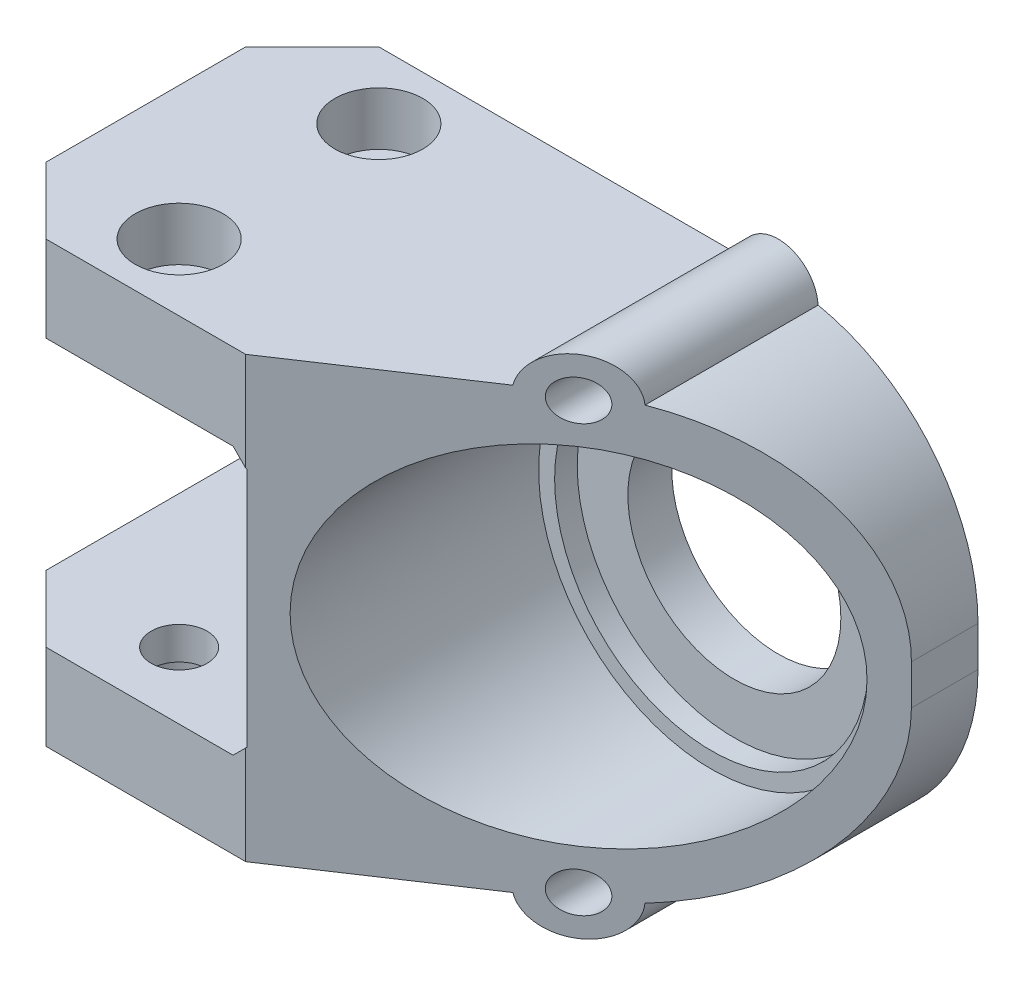
ISO-10303-21;
HEADER;
FILE_DESCRIPTION(('STEP AP214'),'2;1');
FILE_NAME('part.step','',(''),(''),'','','');
FILE_SCHEMA(('AUTOMOTIVE_DESIGN { 1 0 10303 214 1 1 1 1 }'));
ENDSEC;
DATA;
#1=APPLICATION_CONTEXT('core data for automotive mechanical design processes');
#2=APPLICATION_PROTOCOL_DEFINITION('international standard','automotive_design',2000,#1);
#3=PRODUCT_CONTEXT('',#1,'mechanical');
#4=PRODUCT('Part','Part','',(#3));
#5=PRODUCT_RELATED_PRODUCT_CATEGORY('part','',(#4));
#6=PRODUCT_DEFINITION_FORMATION('','',#4);
#7=PRODUCT_DEFINITION_CONTEXT('part definition',#1,'design');
#8=PRODUCT_DEFINITION('design','',#6,#7);
#9=PRODUCT_DEFINITION_SHAPE('','',#8);
#10=(LENGTH_UNIT() NAMED_UNIT(*) SI_UNIT(.MILLI.,.METRE.));
#11=(NAMED_UNIT(*) PLANE_ANGLE_UNIT() SI_UNIT($,.RADIAN.));
#12=(NAMED_UNIT(*) SI_UNIT($,.STERADIAN.) SOLID_ANGLE_UNIT());
#13=UNCERTAINTY_MEASURE_WITH_UNIT(LENGTH_MEASURE(1.E-05),#10,'distance_accuracy_value','');
#14=(GEOMETRIC_REPRESENTATION_CONTEXT(3) GLOBAL_UNCERTAINTY_ASSIGNED_CONTEXT((#13)) GLOBAL_UNIT_ASSIGNED_CONTEXT((#10,
#11,#12)) REPRESENTATION_CONTEXT('',''));
#15=CARTESIAN_POINT('',(0.,0.,0.));
#16=DIRECTION('',(0.,0.,1.));
#17=DIRECTION('',(1.,0.,0.));
#18=AXIS2_PLACEMENT_3D('',#15,#16,#17);
#19=CARTESIAN_POINT('',(0.,33.,0.));
#20=DIRECTION('',(0.,1.,0.));
#21=DIRECTION('',(0.,0.,1.));
#22=AXIS2_PLACEMENT_3D('',#19,#20,#21);
#23=PLANE('',#22);
#24=CARTESIAN_POINT('',(20.,33.,10.));
#25=DIRECTION('',(0.,1.,0.));
#26=DIRECTION('',(0.,0.,1.));
#27=AXIS2_PLACEMENT_3D('',#24,#25,#26);
#28=CIRCLE('',#27,6.6);
#29=CARTESIAN_POINT('',(20.,33.,16.6));
#30=VERTEX_POINT('',#29);
#31=EDGE_CURVE('E290',#30,#30,#28,.T.);
#32=ORIENTED_EDGE('',*,*,#31,.F.);
#33=EDGE_LOOP('',(#32));
#34=FACE_BOUND('',#33,.T.);
#35=CARTESIAN_POINT('',(20.,33.,40.));
#36=DIRECTION('',(0.,1.,0.));
#37=DIRECTION('',(0.,0.,1.));
#38=AXIS2_PLACEMENT_3D('',#35,#36,#37);
#39=CIRCLE('',#38,6.6);
#40=CARTESIAN_POINT('',(20.,33.,46.6));
#41=VERTEX_POINT('',#40);
#42=EDGE_CURVE('E285',#41,#41,#39,.T.);
#43=ORIENTED_EDGE('',*,*,#42,.F.);
#44=EDGE_LOOP('',(#43));
#45=FACE_BOUND('',#44,.T.);
#46=DIRECTION('',(0.832050294337844,0.,-0.554700196225229));
#47=VECTOR('',#46,1.);
#48=CARTESIAN_POINT('',(40.,33.,50.));
#49=LINE('',#48,#47);
#50=CARTESIAN_POINT('',(40.,33.,50.));
#51=VERTEX_POINT('',#50);
#52=CARTESIAN_POINT('',(64.0839202169005,33.,33.944053188733));
#53=VERTEX_POINT('',#52);
#54=EDGE_CURVE('E204',#51,#53,#49,.T.);
#55=ORIENTED_EDGE('',*,*,#54,.T.);
#56=DIRECTION('',(0.,0.,-1.));
#57=VECTOR('',#56,1.);
#58=CARTESIAN_POINT('',(64.0839202169004,33.,47.9217640252692));
#59=LINE('',#58,#57);
#60=CARTESIAN_POINT('',(64.0839202169004,33.,0.));
#61=VERTEX_POINT('',#60);
#62=EDGE_CURVE('E55',#53,#61,#59,.T.);
#63=ORIENTED_EDGE('',*,*,#62,.T.);
#64=DIRECTION('',(-1.,0.,0.));
#65=VECTOR('',#64,1.);
#66=CARTESIAN_POINT('',(100.,33.,0.));
#67=LINE('',#66,#65);
#68=CARTESIAN_POINT('',(10.,33.,0.));
#69=VERTEX_POINT('',#68);
#70=EDGE_CURVE('E191',#61,#69,#67,.T.);
#71=ORIENTED_EDGE('',*,*,#70,.T.);
#72=DIRECTION('',(0.707106781186548,0.,-0.707106781186547));
#73=VECTOR('',#72,1.);
#74=CARTESIAN_POINT('',(5.00000000000001,33.,5.00000000000002));
#75=LINE('',#74,#73);
#76=CARTESIAN_POINT('',(0.,33.,10.));
#77=VERTEX_POINT('',#76);
#78=EDGE_CURVE('E323',#69,#77,#75,.F.);
#79=ORIENTED_EDGE('',*,*,#78,.T.);
#80=DIRECTION('',(0.,0.,1.));
#81=VECTOR('',#80,1.);
#82=CARTESIAN_POINT('',(0.,33.,0.));
#83=LINE('',#82,#81);
#84=CARTESIAN_POINT('',(0.,33.,40.));
#85=VERTEX_POINT('',#84);
#86=EDGE_CURVE('E194',#77,#85,#83,.T.);
#87=ORIENTED_EDGE('',*,*,#86,.T.);
#88=DIRECTION('',(-0.707106781186547,0.,-0.707106781186549));
#89=VECTOR('',#88,1.);
#90=CARTESIAN_POINT('',(-20.,33.,19.9999999999999));
#91=LINE('',#90,#89);
#92=CARTESIAN_POINT('',(10.,33.,50.));
#93=VERTEX_POINT('',#92);
#94=EDGE_CURVE('E325',#85,#93,#91,.F.);
#95=ORIENTED_EDGE('',*,*,#94,.T.);
#96=DIRECTION('',(1.,0.,0.));
#97=VECTOR('',#96,1.);
#98=CARTESIAN_POINT('',(0.,33.,50.));
#99=LINE('',#98,#97);
#100=EDGE_CURVE('E407',#93,#51,#99,.T.);
#101=ORIENTED_EDGE('',*,*,#100,.T.);
#102=EDGE_LOOP('',(#55,#63,#71,#79,#87,#95,#101));
#103=FACE_BOUND('',#102,.T.);
#104=ADVANCED_FACE('F33',(#34,#45,#103),#23,.T.);
#105=CARTESIAN_POINT('',(70.,3.,0.));
#106=DIRECTION('',(0.,0.,1.));
#107=DIRECTION('',(1.,0.,0.));
#108=AXIS2_PLACEMENT_3D('',#105,#106,#107);
#109=CYLINDRICAL_SURFACE('',#108,30.);
#110=CARTESIAN_POINT('',(70.,3.,0.));
#111=DIRECTION('',(0.,0.,1.));
#112=DIRECTION('',(1.,0.,0.));
#113=AXIS2_PLACEMENT_3D('',#110,#111,#112);
#114=CIRCLE('',#113,30.);
#115=CARTESIAN_POINT('',(75.9868812189723,32.3965517241379,0.));
#116=VERTEX_POINT('',#115);
#117=CARTESIAN_POINT('',(100.,3.,0.));
#118=VERTEX_POINT('',#117);
#119=EDGE_CURVE('E234',#116,#118,#114,.F.);
#120=ORIENTED_EDGE('',*,*,#119,.F.);
#121=DIRECTION('',(0.,0.,-1.));
#122=VECTOR('',#121,1.);
#123=CARTESIAN_POINT('',(75.9868812189723,32.3965517241379,17.102));
#124=LINE('',#123,#122);
#125=CARTESIAN_POINT('',(75.9868812189723,32.3965517241379,26.0087458540185));
#126=VERTEX_POINT('',#125);
#127=EDGE_CURVE('E41',#116,#126,#124,.F.);
#128=ORIENTED_EDGE('',*,*,#127,.T.);
#129=CARTESIAN_POINT('',(70.,3.,30.));
#130=DIRECTION('',(-0.554700196225229,0.,-0.832050294337844));
#131=DIRECTION('',(-0.832050294337844,0.,0.554700196225229));
#132=AXIS2_PLACEMENT_3D('',#129,#130,#131);
#133=ELLIPSE('',#132,36.0555127546399,30.);
#134=CARTESIAN_POINT('',(100.,3.,10.));
#135=VERTEX_POINT('',#134);
#136=EDGE_CURVE('E243',#135,#126,#133,.F.);
#137=ORIENTED_EDGE('',*,*,#136,.F.);
#138=DIRECTION('',(0.,0.,-1.));
#139=VECTOR('',#138,1.);
#140=CARTESIAN_POINT('',(100.,3.,10.));
#141=LINE('',#140,#139);
#142=EDGE_CURVE('E239',#118,#135,#141,.F.);
#143=ORIENTED_EDGE('',*,*,#142,.F.);
#144=EDGE_LOOP('',(#120,#128,#137,#143));
#145=FACE_BOUND('',#144,.T.);
#146=ADVANCED_FACE('F330',(#145),#109,.T.);
#147=CARTESIAN_POINT('',(70.,0.,50.));
#148=DIRECTION('',(0.,0.,-1.));
#149=DIRECTION('',(-1.,0.,0.));
#150=AXIS2_PLACEMENT_3D('',#147,#148,#149);
#151=CYLINDRICAL_SURFACE('',#150,16.);
#152=CARTESIAN_POINT('',(70.,0.,0.));
#153=DIRECTION('',(0.,0.,1.));
#154=DIRECTION('',(1.,0.,0.));
#155=AXIS2_PLACEMENT_3D('',#152,#153,#154);
#156=CIRCLE('',#155,16.);
#157=CARTESIAN_POINT('',(86.,0.,0.));
#158=VERTEX_POINT('',#157);
#159=EDGE_CURVE('E226',#158,#158,#156,.T.);
#160=ORIENTED_EDGE('',*,*,#159,.F.);
#161=EDGE_LOOP('',(#160));
#162=FACE_BOUND('',#161,.T.);
#163=CARTESIAN_POINT('',(70.,0.,6.60000000000001));
#164=DIRECTION('',(0.,0.,1.));
#165=DIRECTION('',(1.,0.,0.));
#166=AXIS2_PLACEMENT_3D('',#163,#164,#165);
#167=CIRCLE('',#166,16.);
#168=CARTESIAN_POINT('',(86.,0.,6.60000000000001));
#169=VERTEX_POINT('',#168);
#170=EDGE_CURVE('E228',#169,#169,#167,.T.);
#171=ORIENTED_EDGE('',*,*,#170,.T.);
#172=EDGE_LOOP('',(#171));
#173=FACE_BOUND('',#172,.T.);
#174=ADVANCED_FACE('F458',(#162,#173),#151,.F.);
#175=CARTESIAN_POINT('',(100.,33.,0.));
#176=DIRECTION('',(0.,0.,1.));
#177=DIRECTION('',(1.,0.,0.));
#178=AXIS2_PLACEMENT_3D('',#175,#176,#177);
#179=PLANE('',#178);
#180=CARTESIAN_POINT('',(70.,-32.,0.));
#181=DIRECTION('',(0.,0.,-1.));
#182=DIRECTION('',(-1.,0.,0.));
#183=AXIS2_PLACEMENT_3D('',#180,#181,#182);
#184=CIRCLE('',#183,5.99999999999998);
#185=CARTESIAN_POINT('',(75.9868812189723,-32.3965517241379,0.));
#186=VERTEX_POINT('',#185);
#187=CARTESIAN_POINT('',(64.0839202169004,-33.,0.));
#188=VERTEX_POINT('',#187);
#189=EDGE_CURVE('E174',#186,#188,#184,.T.);
#190=ORIENTED_EDGE('',*,*,#189,.T.);
#191=DIRECTION('',(-1.,0.,0.));
#192=VECTOR('',#191,1.);
#193=CARTESIAN_POINT('',(100.,-33.,0.));
#194=LINE('',#193,#192);
#195=CARTESIAN_POINT('',(10.,-33.,0.));
#196=VERTEX_POINT('',#195);
#197=EDGE_CURVE('E183',#188,#196,#194,.T.);
#198=ORIENTED_EDGE('',*,*,#197,.T.);
#199=DIRECTION('',(0.,1.,0.));
#200=VECTOR('',#199,1.);
#201=CARTESIAN_POINT('',(10.,33.,0.));
#202=LINE('',#201,#200);
#203=CARTESIAN_POINT('',(10.,-20.1,0.));
#204=VERTEX_POINT('',#203);
#205=EDGE_CURVE('E302',#196,#204,#202,.T.);
#206=ORIENTED_EDGE('',*,*,#205,.T.);
#207=DIRECTION('',(1.,0.,0.));
#208=VECTOR('',#207,1.);
#209=CARTESIAN_POINT('',(-0.0999999999999994,-20.1,0.));
#210=LINE('',#209,#208);
#211=CARTESIAN_POINT('',(38.1,-20.1,0.));
#212=VERTEX_POINT('',#211);
#213=EDGE_CURVE('E384',#204,#212,#210,.T.);
#214=ORIENTED_EDGE('',*,*,#213,.T.);
#215=DIRECTION('',(-0.707106781186551,-0.707106781186544,0.));
#216=VECTOR('',#215,1.);
#217=CARTESIAN_POINT('',(95.6000000000003,37.3999999999998,0.));
#218=LINE('',#217,#216);
#219=CARTESIAN_POINT('',(40.1,-18.1,0.));
#220=VERTEX_POINT('',#219);
#221=EDGE_CURVE('E256',#212,#220,#218,.F.);
#222=ORIENTED_EDGE('',*,*,#221,.T.);
#223=DIRECTION('',(0.,1.,0.));
#224=VECTOR('',#223,1.);
#225=CARTESIAN_POINT('',(40.1,20.1,0.));
#226=LINE('',#225,#224);
#227=CARTESIAN_POINT('',(40.1,18.1,0.));
#228=VERTEX_POINT('',#227);
#229=EDGE_CURVE('E391',#220,#228,#226,.T.);
#230=ORIENTED_EDGE('',*,*,#229,.T.);
#231=DIRECTION('',(0.707106781186545,-0.70710678118655,0.));
#232=VECTOR('',#231,1.);
#233=CARTESIAN_POINT('',(62.5999999999998,-4.39999999999995,0.));
#234=LINE('',#233,#232);
#235=CARTESIAN_POINT('',(38.1,20.1,0.));
#236=VERTEX_POINT('',#235);
#237=EDGE_CURVE('E263',#228,#236,#234,.F.);
#238=ORIENTED_EDGE('',*,*,#237,.T.);
#239=DIRECTION('',(-1.,0.,0.));
#240=VECTOR('',#239,1.);
#241=CARTESIAN_POINT('',(-0.100000000000003,20.1,0.));
#242=LINE('',#241,#240);
#243=CARTESIAN_POINT('',(10.,20.1,0.));
#244=VERTEX_POINT('',#243);
#245=EDGE_CURVE('E387',#236,#244,#242,.T.);
#246=ORIENTED_EDGE('',*,*,#245,.T.);
#247=DIRECTION('',(0.,1.,0.));
#248=VECTOR('',#247,1.);
#249=CARTESIAN_POINT('',(10.,33.,0.));
#250=LINE('',#249,#248);
#251=EDGE_CURVE('E299',#244,#69,#250,.T.);
#252=ORIENTED_EDGE('',*,*,#251,.T.);
#253=ORIENTED_EDGE('',*,*,#70,.F.);
#254=CARTESIAN_POINT('',(70.,32.,0.));
#255=DIRECTION('',(0.,0.,1.));
#256=DIRECTION('',(-1.,0.,0.));
#257=AXIS2_PLACEMENT_3D('',#254,#255,#256);
#258=CIRCLE('',#257,5.99999999999998);
#259=EDGE_CURVE('E348',#116,#61,#258,.T.);
#260=ORIENTED_EDGE('',*,*,#259,.F.);
#261=ORIENTED_EDGE('',*,*,#119,.T.);
#262=DIRECTION('',(0.,-1.,0.));
#263=VECTOR('',#262,1.);
#264=CARTESIAN_POINT('',(100.,33.,0.));
#265=LINE('',#264,#263);
#266=CARTESIAN_POINT('',(100.,-3.,0.));
#267=VERTEX_POINT('',#266);
#268=EDGE_CURVE('E200',#118,#267,#265,.T.);
#269=ORIENTED_EDGE('',*,*,#268,.T.);
#270=CARTESIAN_POINT('',(70.,-3.,0.));
#271=DIRECTION('',(0.,0.,1.));
#272=DIRECTION('',(1.,0.,0.));
#273=AXIS2_PLACEMENT_3D('',#270,#271,#272);
#274=CIRCLE('',#273,30.);
#275=EDGE_CURVE('E222',#267,#186,#274,.F.);
#276=ORIENTED_EDGE('',*,*,#275,.T.);
#277=EDGE_LOOP('',(#190,#198,#206,#214,#222,#230,#238,#246,#252,#253,#260,#261,#269,#276));
#278=FACE_BOUND('',#277,.T.);
#279=CARTESIAN_POINT('',(70.,32.,0.));
#280=DIRECTION('',(0.,0.,1.));
#281=DIRECTION('',(1.,0.,0.));
#282=AXIS2_PLACEMENT_3D('',#279,#280,#281);
#283=CIRCLE('',#282,3.00000000000001);
#284=CARTESIAN_POINT('',(73.,32.,0.));
#285=VERTEX_POINT('',#284);
#286=EDGE_CURVE('E184',#285,#285,#283,.T.);
#287=ORIENTED_EDGE('',*,*,#286,.T.);
#288=EDGE_LOOP('',(#287));
#289=FACE_BOUND('',#288,.T.);
#290=ORIENTED_EDGE('',*,*,#159,.T.);
#291=EDGE_LOOP('',(#290));
#292=FACE_BOUND('',#291,.T.);
#293=CARTESIAN_POINT('',(70.,-32.,0.));
#294=DIRECTION('',(0.,0.,-1.));
#295=DIRECTION('',(1.,0.,0.));
#296=AXIS2_PLACEMENT_3D('',#293,#294,#295);
#297=CIRCLE('',#296,3.00000000000001);
#298=CARTESIAN_POINT('',(73.,-32.,0.));
#299=VERTEX_POINT('',#298);
#300=EDGE_CURVE('E830',#299,#299,#297,.T.);
#301=ORIENTED_EDGE('',*,*,#300,.F.);
#302=EDGE_LOOP('',(#301));
#303=FACE_BOUND('',#302,.T.);
#304=ADVANCED_FACE('F346',(#278,#289,#292,#303),#179,.F.);
#305=CARTESIAN_POINT('',(0.,33.,0.));
#306=DIRECTION('',(1.,0.,0.));
#307=DIRECTION('',(0.,0.,-1.));
#308=AXIS2_PLACEMENT_3D('',#305,#306,#307);
#309=PLANE('',#308);
#310=DIRECTION('',(0.,0.,1.));
#311=VECTOR('',#310,1.);
#312=CARTESIAN_POINT('',(0.,-20.1,0.));
#313=LINE('',#312,#311);
#314=CARTESIAN_POINT('',(0.,-20.1,10.));
#315=VERTEX_POINT('',#314);
#316=CARTESIAN_POINT('',(0.,-20.1,40.));
#317=VERTEX_POINT('',#316);
#318=EDGE_CURVE('E402',#315,#317,#313,.T.);
#319=ORIENTED_EDGE('',*,*,#318,.F.);
#320=DIRECTION('',(0.,-1.,0.));
#321=VECTOR('',#320,1.);
#322=CARTESIAN_POINT('',(0.,33.,10.));
#323=LINE('',#322,#321);
#324=CARTESIAN_POINT('',(0.,-33.,10.));
#325=VERTEX_POINT('',#324);
#326=EDGE_CURVE('E292',#315,#325,#323,.T.);
#327=ORIENTED_EDGE('',*,*,#326,.T.);
#328=DIRECTION('',(0.,0.,1.));
#329=VECTOR('',#328,1.);
#330=CARTESIAN_POINT('',(0.,-33.,0.));
#331=LINE('',#330,#329);
#332=CARTESIAN_POINT('',(0.,-33.,40.));
#333=VERTEX_POINT('',#332);
#334=EDGE_CURVE('E196',#325,#333,#331,.T.);
#335=ORIENTED_EDGE('',*,*,#334,.T.);
#336=DIRECTION('',(0.,1.,0.));
#337=VECTOR('',#336,1.);
#338=CARTESIAN_POINT('',(0.,33.,40.));
#339=LINE('',#338,#337);
#340=EDGE_CURVE('E270',#333,#317,#339,.T.);
#341=ORIENTED_EDGE('',*,*,#340,.T.);
#342=EDGE_LOOP('',(#319,#327,#335,#341));
#343=FACE_BOUND('',#342,.T.);
#344=ADVANCED_FACE('F415',(#343),#309,.F.);
#345=DIRECTION('',(0.,0.,-1.));
#346=VECTOR('',#345,1.);
#347=CARTESIAN_POINT('',(0.,20.1,0.));
#348=LINE('',#347,#346);
#349=CARTESIAN_POINT('',(0.,20.1,40.));
#350=VERTEX_POINT('',#349);
#351=CARTESIAN_POINT('',(0.,20.1,10.));
#352=VERTEX_POINT('',#351);
#353=EDGE_CURVE('E219',#350,#352,#348,.T.);
#354=ORIENTED_EDGE('',*,*,#353,.F.);
#355=DIRECTION('',(0.,1.,0.));
#356=VECTOR('',#355,1.);
#357=CARTESIAN_POINT('',(0.,33.,40.));
#358=LINE('',#357,#356);
#359=EDGE_CURVE('E321',#350,#85,#358,.T.);
#360=ORIENTED_EDGE('',*,*,#359,.T.);
#361=ORIENTED_EDGE('',*,*,#86,.F.);
#362=DIRECTION('',(0.,-1.,0.));
#363=VECTOR('',#362,1.);
#364=CARTESIAN_POINT('',(0.,33.,10.));
#365=LINE('',#364,#363);
#366=EDGE_CURVE('E318',#77,#352,#365,.T.);
#367=ORIENTED_EDGE('',*,*,#366,.T.);
#368=EDGE_LOOP('',(#354,#360,#361,#367));
#369=FACE_BOUND('',#368,.T.);
#370=ADVANCED_FACE('F479',(#369),#309,.F.);
#371=CARTESIAN_POINT('',(0.,33.,50.));
#372=DIRECTION('',(0.,0.,-1.));
#373=DIRECTION('',(-1.,0.,0.));
#374=AXIS2_PLACEMENT_3D('',#371,#372,#373);
#375=PLANE('',#374);
#376=DIRECTION('',(1.,0.,0.));
#377=VECTOR('',#376,1.);
#378=CARTESIAN_POINT('',(-0.0999999999999994,-20.1,50.));
#379=LINE('',#378,#377);
#380=CARTESIAN_POINT('',(10.,-20.1,50.));
#381=VERTEX_POINT('',#380);
#382=CARTESIAN_POINT('',(38.1,-20.1,50.));
#383=VERTEX_POINT('',#382);
#384=EDGE_CURVE('E385',#381,#383,#379,.T.);
#385=ORIENTED_EDGE('',*,*,#384,.F.);
#386=DIRECTION('',(0.,-1.,0.));
#387=VECTOR('',#386,1.);
#388=CARTESIAN_POINT('',(10.,33.,50.));
#389=LINE('',#388,#387);
#390=CARTESIAN_POINT('',(10.,-33.,50.));
#391=VERTEX_POINT('',#390);
#392=EDGE_CURVE('E308',#381,#391,#389,.T.);
#393=ORIENTED_EDGE('',*,*,#392,.T.);
#394=DIRECTION('',(1.,0.,0.));
#395=VECTOR('',#394,1.);
#396=CARTESIAN_POINT('',(0.,-33.,50.));
#397=LINE('',#396,#395);
#398=CARTESIAN_POINT('',(40.,-33.,50.));
#399=VERTEX_POINT('',#398);
#400=EDGE_CURVE('E192',#391,#399,#397,.T.);
#401=ORIENTED_EDGE('',*,*,#400,.T.);
#402=DIRECTION('',(0.,-1.,0.));
#403=VECTOR('',#402,1.);
#404=CARTESIAN_POINT('',(40.,33.,50.));
#405=LINE('',#404,#403);
#406=CARTESIAN_POINT('',(40.,-18.2,50.));
#407=VERTEX_POINT('',#406);
#408=EDGE_CURVE('E190',#407,#399,#405,.T.);
#409=ORIENTED_EDGE('',*,*,#408,.F.);
#410=DIRECTION('',(0.707106781186551,0.707106781186544,0.));
#411=VECTOR('',#410,1.);
#412=CARTESIAN_POINT('',(45.5999999999998,-12.6000000000002,50.));
#413=LINE('',#412,#411);
#414=EDGE_CURVE('E260',#407,#383,#413,.F.);
#415=ORIENTED_EDGE('',*,*,#414,.T.);
#416=EDGE_LOOP('',(#385,#393,#401,#409,#415));
#417=FACE_BOUND('',#416,.T.);
#418=ADVANCED_FACE('F426',(#417),#375,.F.);
#419=ORIENTED_EDGE('',*,*,#100,.F.);
#420=DIRECTION('',(0.,-1.,0.));
#421=VECTOR('',#420,1.);
#422=CARTESIAN_POINT('',(10.,33.,50.));
#423=LINE('',#422,#421);
#424=CARTESIAN_POINT('',(10.,20.1,50.));
#425=VERTEX_POINT('',#424);
#426=EDGE_CURVE('E311',#93,#425,#423,.T.);
#427=ORIENTED_EDGE('',*,*,#426,.T.);
#428=DIRECTION('',(-1.,0.,0.));
#429=VECTOR('',#428,1.);
#430=CARTESIAN_POINT('',(-0.100000000000003,20.1,50.));
#431=LINE('',#430,#429);
#432=CARTESIAN_POINT('',(38.1,20.1,50.));
#433=VERTEX_POINT('',#432);
#434=EDGE_CURVE('E214',#433,#425,#431,.T.);
#435=ORIENTED_EDGE('',*,*,#434,.F.);
#436=DIRECTION('',(-0.707106781186545,0.70710678118655,0.));
#437=VECTOR('',#436,1.);
#438=CARTESIAN_POINT('',(12.6000000000001,45.6000000000001,50.));
#439=LINE('',#438,#437);
#440=CARTESIAN_POINT('',(40.,18.2,50.));
#441=VERTEX_POINT('',#440);
#442=EDGE_CURVE('E265',#433,#441,#439,.F.);
#443=ORIENTED_EDGE('',*,*,#442,.T.);
#444=EDGE_CURVE('E207',#51,#441,#405,.T.);
#445=ORIENTED_EDGE('',*,*,#444,.F.);
#446=EDGE_LOOP('',(#419,#427,#435,#443,#445));
#447=FACE_BOUND('',#446,.T.);
#448=ADVANCED_FACE('F475',(#447),#375,.F.);
#449=CARTESIAN_POINT('',(40.,33.,50.));
#450=DIRECTION('',(-0.554700196225229,0.,-0.832050294337844));
#451=DIRECTION('',(-0.832050294337844,0.,0.554700196225229));
#452=AXIS2_PLACEMENT_3D('',#449,#450,#451);
#453=PLANE('',#452);
#454=CARTESIAN_POINT('',(70.,32.,30.));
#455=DIRECTION('',(-0.554700196225229,0.,-0.832050294337844));
#456=DIRECTION('',(0.832050294337844,0.,-0.554700196225229));
#457=AXIS2_PLACEMENT_3D('',#454,#455,#456);
#458=ELLIPSE('',#457,3.605551275464,3.00000000000001);
#459=CARTESIAN_POINT('',(73.,32.,28.));
#460=VERTEX_POINT('',#459);
#461=EDGE_CURVE('E349',#460,#460,#458,.T.);
#462=ORIENTED_EDGE('',*,*,#461,.T.);
#463=EDGE_LOOP('',(#462));
#464=FACE_BOUND('',#463,.T.);
#465=DIRECTION('',(0.832050294337844,0.,-0.554700196225229));
#466=VECTOR('',#465,1.);
#467=CARTESIAN_POINT('',(40.,-33.,50.));
#468=LINE('',#467,#466);
#469=CARTESIAN_POINT('',(64.0839202169005,-33.,33.944053188733));
#470=VERTEX_POINT('',#469);
#471=EDGE_CURVE('E181',#399,#470,#468,.T.);
#472=ORIENTED_EDGE('',*,*,#471,.T.);
#473=CARTESIAN_POINT('',(70.,-32.,30.));
#474=DIRECTION('',(-0.554700196225229,0.,-0.832050294337844));
#475=DIRECTION('',(0.832050294337844,0.,-0.554700196225229));
#476=AXIS2_PLACEMENT_3D('',#473,#474,#475);
#477=ELLIPSE('',#476,7.21110255092795,5.99999999999998);
#478=CARTESIAN_POINT('',(75.9868812189723,-32.3965517241379,26.0087458540185));
#479=VERTEX_POINT('',#478);
#480=EDGE_CURVE('E48',#470,#479,#477,.F.);
#481=ORIENTED_EDGE('',*,*,#480,.T.);
#482=CARTESIAN_POINT('',(70.,-3.,30.));
#483=DIRECTION('',(-0.554700196225229,0.,-0.832050294337844));
#484=DIRECTION('',(0.832050294337844,0.,-0.554700196225229));
#485=AXIS2_PLACEMENT_3D('',#482,#483,#484);
#486=ELLIPSE('',#485,36.0555127546399,30.);
#487=CARTESIAN_POINT('',(100.,-3.,10.));
#488=VERTEX_POINT('',#487);
#489=EDGE_CURVE('E241',#479,#488,#486,.F.);
#490=ORIENTED_EDGE('',*,*,#489,.T.);
#491=DIRECTION('',(0.,-1.,0.));
#492=VECTOR('',#491,1.);
#493=CARTESIAN_POINT('',(100.,33.,10.));
#494=LINE('',#493,#492);
#495=EDGE_CURVE('E203',#135,#488,#494,.T.);
#496=ORIENTED_EDGE('',*,*,#495,.F.);
#497=ORIENTED_EDGE('',*,*,#136,.T.);
#498=CARTESIAN_POINT('',(70.,32.,30.));
#499=DIRECTION('',(-0.554700196225229,0.,-0.832050294337844));
#500=DIRECTION('',(0.832050294337844,0.,-0.554700196225229));
#501=AXIS2_PLACEMENT_3D('',#498,#499,#500);
#502=ELLIPSE('',#501,7.21110255092795,5.99999999999998);
#503=EDGE_CURVE('E338',#53,#126,#502,.T.);
#504=ORIENTED_EDGE('',*,*,#503,.F.);
#505=ORIENTED_EDGE('',*,*,#54,.F.);
#506=ORIENTED_EDGE('',*,*,#444,.T.);
#507=DIRECTION('',(-0.63960214906683,0.639602149066834,0.426401432711219));
#508=VECTOR('',#507,1.);
#509=CARTESIAN_POINT('',(33.9454545454545,24.2545454545455,54.0363636363636));
#510=LINE('',#509,#508);
#511=CARTESIAN_POINT('',(40.1,18.1,49.9333333333333));
#512=VERTEX_POINT('',#511);
#513=EDGE_CURVE('E268',#441,#512,#510,.F.);
#514=ORIENTED_EDGE('',*,*,#513,.T.);
#515=DIRECTION('',(0.,1.,0.));
#516=VECTOR('',#515,1.);
#517=CARTESIAN_POINT('',(40.1,33.,49.9333333333333));
#518=LINE('',#517,#516);
#519=CARTESIAN_POINT('',(40.1,-18.1,49.9333333333333));
#520=VERTEX_POINT('',#519);
#521=EDGE_CURVE('E209',#520,#512,#518,.T.);
#522=ORIENTED_EDGE('',*,*,#521,.F.);
#523=DIRECTION('',(0.639602149066834,0.639602149066828,-0.426401432711222));
#524=VECTOR('',#523,1.);
#525=CARTESIAN_POINT('',(60.9454545454545,2.74545454545432,36.0363636363636));
#526=LINE('',#525,#524);
#527=EDGE_CURVE('E258',#520,#407,#526,.F.);
#528=ORIENTED_EDGE('',*,*,#527,.T.);
#529=ORIENTED_EDGE('',*,*,#408,.T.);
#530=EDGE_LOOP('',(#472,#481,#490,#496,#497,#504,#505,#506,#514,#522,#528,#529));
#531=FACE_BOUND('',#530,.T.);
#532=CARTESIAN_POINT('',(70.,0.,30.));
#533=DIRECTION('',(-0.554700196225229,0.,-0.832050294337844));
#534=DIRECTION('',(0.832050294337844,0.,-0.554700196225229));
#535=AXIS2_PLACEMENT_3D('',#532,#533,#534);
#536=ELLIPSE('',#535,31.2481110540212,26.);
#537=CARTESIAN_POINT('',(96.,0.,12.6666666666667));
#538=VERTEX_POINT('',#537);
#539=EDGE_CURVE('E223',#538,#538,#536,.F.);
#540=ORIENTED_EDGE('',*,*,#539,.F.);
#541=EDGE_LOOP('',(#540));
#542=FACE_BOUND('',#541,.T.);
#543=CARTESIAN_POINT('',(70.,-32.,30.));
#544=DIRECTION('',(-0.554700196225229,0.,-0.832050294337844));
#545=DIRECTION('',(0.832050294337844,0.,-0.554700196225229));
#546=AXIS2_PLACEMENT_3D('',#543,#544,#545);
#547=ELLIPSE('',#546,3.605551275464,3.00000000000001);
#548=CARTESIAN_POINT('',(73.,-32.,28.));
#549=VERTEX_POINT('',#548);
#550=EDGE_CURVE('E173',#549,#549,#547,.F.);
#551=ORIENTED_EDGE('',*,*,#550,.F.);
#552=EDGE_LOOP('',(#551));
#553=FACE_BOUND('',#552,.T.);
#554=ADVANCED_FACE('F187',(#464,#531,#542,#553),#453,.F.);
#555=CARTESIAN_POINT('',(20.,33.,40.));
#556=DIRECTION('',(0.,-1.,0.));
#557=DIRECTION('',(0.,0.,-1.));
#558=AXIS2_PLACEMENT_3D('',#555,#556,#557);
#559=CYLINDRICAL_SURFACE('',#558,4.2);
#560=CARTESIAN_POINT('',(20.,-25.,40.));
#561=DIRECTION('',(0.,1.,0.));
#562=DIRECTION('',(0.,0.,1.));
#563=AXIS2_PLACEMENT_3D('',#560,#561,#562);
#564=CIRCLE('',#563,4.2);
#565=CARTESIAN_POINT('',(20.,-25.,44.2));
#566=VERTEX_POINT('',#565);
#567=EDGE_CURVE('E271',#566,#566,#564,.T.);
#568=ORIENTED_EDGE('',*,*,#567,.F.);
#569=EDGE_LOOP('',(#568));
#570=FACE_BOUND('',#569,.T.);
#571=CARTESIAN_POINT('',(20.,-20.1,40.));
#572=DIRECTION('',(0.,1.,0.));
#573=DIRECTION('',(-1.,0.,0.));
#574=AXIS2_PLACEMENT_3D('',#571,#572,#573);
#575=CIRCLE('',#574,4.2);
#576=CARTESIAN_POINT('',(15.8,-20.1,40.));
#577=VERTEX_POINT('',#576);
#578=EDGE_CURVE('E218',#577,#577,#575,.T.);
#579=ORIENTED_EDGE('',*,*,#578,.T.);
#580=EDGE_LOOP('',(#579));
#581=FACE_BOUND('',#580,.T.);
#582=ADVANCED_FACE('F464',(#570,#581),#559,.F.);
#583=CARTESIAN_POINT('',(20.,25.,40.));
#584=DIRECTION('',(0.,-1.,0.));
#585=DIRECTION('',(0.,0.,-1.));
#586=AXIS2_PLACEMENT_3D('',#583,#584,#585);
#587=CIRCLE('',#586,4.2);
#588=CARTESIAN_POINT('',(20.,25.,35.8));
#589=VERTEX_POINT('',#588);
#590=EDGE_CURVE('E281',#589,#589,#587,.T.);
#591=ORIENTED_EDGE('',*,*,#590,.F.);
#592=EDGE_LOOP('',(#591));
#593=FACE_BOUND('',#592,.T.);
#594=CARTESIAN_POINT('',(20.,20.1,40.));
#595=DIRECTION('',(0.,-1.,0.));
#596=DIRECTION('',(0.,0.,-1.));
#597=AXIS2_PLACEMENT_3D('',#594,#595,#596);
#598=CIRCLE('',#597,4.2);
#599=CARTESIAN_POINT('',(20.,20.1,35.8));
#600=VERTEX_POINT('',#599);
#601=EDGE_CURVE('E213',#600,#600,#598,.T.);
#602=ORIENTED_EDGE('',*,*,#601,.T.);
#603=EDGE_LOOP('',(#602));
#604=FACE_BOUND('',#603,.T.);
#605=ADVANCED_FACE('F583',(#593,#604),#559,.F.);
#606=CARTESIAN_POINT('',(20.,33.,10.));
#607=DIRECTION('',(0.,-1.,0.));
#608=DIRECTION('',(0.,0.,-1.));
#609=AXIS2_PLACEMENT_3D('',#606,#607,#608);
#610=CYLINDRICAL_SURFACE('',#609,4.2);
#611=CARTESIAN_POINT('',(20.,-25.,10.));
#612=DIRECTION('',(0.,1.,0.));
#613=DIRECTION('',(0.,0.,1.));
#614=AXIS2_PLACEMENT_3D('',#611,#612,#613);
#615=CIRCLE('',#614,4.2);
#616=CARTESIAN_POINT('',(20.,-25.,14.2));
#617=VERTEX_POINT('',#616);
#618=EDGE_CURVE('E276',#617,#617,#615,.T.);
#619=ORIENTED_EDGE('',*,*,#618,.F.);
#620=EDGE_LOOP('',(#619));
#621=FACE_BOUND('',#620,.T.);
#622=CARTESIAN_POINT('',(20.,-20.1,10.));
#623=DIRECTION('',(0.,1.,0.));
#624=DIRECTION('',(-1.,0.,0.));
#625=AXIS2_PLACEMENT_3D('',#622,#623,#624);
#626=CIRCLE('',#625,4.2);
#627=CARTESIAN_POINT('',(15.8,-20.1,10.));
#628=VERTEX_POINT('',#627);
#629=EDGE_CURVE('E215',#628,#628,#626,.T.);
#630=ORIENTED_EDGE('',*,*,#629,.T.);
#631=EDGE_LOOP('',(#630));
#632=FACE_BOUND('',#631,.T.);
#633=ADVANCED_FACE('F581',(#621,#632),#610,.F.);
#634=CARTESIAN_POINT('',(20.,25.,10.));
#635=DIRECTION('',(0.,-1.,0.));
#636=DIRECTION('',(0.,0.,-1.));
#637=AXIS2_PLACEMENT_3D('',#634,#635,#636);
#638=CIRCLE('',#637,4.2);
#639=CARTESIAN_POINT('',(20.,25.,5.80000000000001));
#640=VERTEX_POINT('',#639);
#641=EDGE_CURVE('E286',#640,#640,#638,.T.);
#642=ORIENTED_EDGE('',*,*,#641,.F.);
#643=EDGE_LOOP('',(#642));
#644=FACE_BOUND('',#643,.T.);
#645=CARTESIAN_POINT('',(20.,20.1,10.));
#646=DIRECTION('',(0.,-1.,0.));
#647=DIRECTION('',(0.,0.,-1.));
#648=AXIS2_PLACEMENT_3D('',#645,#646,#647);
#649=CIRCLE('',#648,4.2);
#650=CARTESIAN_POINT('',(20.,20.1,5.80000000000001));
#651=VERTEX_POINT('',#650);
#652=EDGE_CURVE('E210',#651,#651,#649,.T.);
#653=ORIENTED_EDGE('',*,*,#652,.T.);
#654=EDGE_LOOP('',(#653));
#655=FACE_BOUND('',#654,.T.);
#656=ADVANCED_FACE('F468',(#644,#655),#610,.F.);
#657=CARTESIAN_POINT('',(0.,-33.,0.));
#658=DIRECTION('',(0.,1.,0.));
#659=DIRECTION('',(0.,0.,1.));
#660=AXIS2_PLACEMENT_3D('',#657,#658,#659);
#661=PLANE('',#660);
#662=CARTESIAN_POINT('',(20.,-33.,10.));
#663=DIRECTION('',(0.,1.,0.));
#664=DIRECTION('',(0.,0.,1.));
#665=AXIS2_PLACEMENT_3D('',#662,#663,#664);
#666=CIRCLE('',#665,6.6);
#667=CARTESIAN_POINT('',(20.,-33.,16.6));
#668=VERTEX_POINT('',#667);
#669=EDGE_CURVE('E280',#668,#668,#666,.T.);
#670=ORIENTED_EDGE('',*,*,#669,.T.);
#671=EDGE_LOOP('',(#670));
#672=FACE_BOUND('',#671,.T.);
#673=CARTESIAN_POINT('',(20.,-33.,40.));
#674=DIRECTION('',(0.,1.,0.));
#675=DIRECTION('',(0.,0.,1.));
#676=AXIS2_PLACEMENT_3D('',#673,#674,#675);
#677=CIRCLE('',#676,6.6);
#678=CARTESIAN_POINT('',(20.,-33.,46.6));
#679=VERTEX_POINT('',#678);
#680=EDGE_CURVE('E275',#679,#679,#677,.T.);
#681=ORIENTED_EDGE('',*,*,#680,.T.);
#682=EDGE_LOOP('',(#681));
#683=FACE_BOUND('',#682,.T.);
#684=ORIENTED_EDGE('',*,*,#197,.F.);
#685=DIRECTION('',(0.,0.,-1.));
#686=VECTOR('',#685,1.);
#687=CARTESIAN_POINT('',(64.0839202169004,-33.,47.9217640252692));
#688=LINE('',#687,#686);
#689=EDGE_CURVE('E169',#188,#470,#688,.F.);
#690=ORIENTED_EDGE('',*,*,#689,.T.);
#691=ORIENTED_EDGE('',*,*,#471,.F.);
#692=ORIENTED_EDGE('',*,*,#400,.F.);
#693=DIRECTION('',(0.707106781186547,0.,0.707106781186549));
#694=VECTOR('',#693,1.);
#695=CARTESIAN_POINT('',(10.,-33.,50.));
#696=LINE('',#695,#694);
#697=EDGE_CURVE('E295',#391,#333,#696,.F.);
#698=ORIENTED_EDGE('',*,*,#697,.T.);
#699=ORIENTED_EDGE('',*,*,#334,.F.);
#700=DIRECTION('',(-0.707106781186548,0.,0.707106781186547));
#701=VECTOR('',#700,1.);
#702=CARTESIAN_POINT('',(0.,-33.,10.));
#703=LINE('',#702,#701);
#704=EDGE_CURVE('E297',#325,#196,#703,.F.);
#705=ORIENTED_EDGE('',*,*,#704,.T.);
#706=EDGE_LOOP('',(#684,#690,#691,#692,#698,#699,#705));
#707=FACE_BOUND('',#706,.T.);
#708=ADVANCED_FACE('F179',(#672,#683,#707),#661,.F.);
#709=CARTESIAN_POINT('',(100.,33.,10.));
#710=DIRECTION('',(-1.,0.,0.));
#711=DIRECTION('',(0.,0.,1.));
#712=AXIS2_PLACEMENT_3D('',#709,#710,#711);
#713=PLANE('',#712);
#714=ORIENTED_EDGE('',*,*,#268,.F.);
#715=ORIENTED_EDGE('',*,*,#142,.T.);
#716=ORIENTED_EDGE('',*,*,#495,.T.);
#717=DIRECTION('',(0.,0.,-1.));
#718=VECTOR('',#717,1.);
#719=CARTESIAN_POINT('',(100.,-3.,10.));
#720=LINE('',#719,#718);
#721=EDGE_CURVE('E236',#488,#267,#720,.T.);
#722=ORIENTED_EDGE('',*,*,#721,.T.);
#723=EDGE_LOOP('',(#714,#715,#716,#722));
#724=FACE_BOUND('',#723,.T.);
#725=ADVANCED_FACE('F342',(#724),#713,.F.);
#726=CARTESIAN_POINT('',(40.1,20.1,50.));
#727=DIRECTION('',(-1.,0.,0.));
#728=DIRECTION('',(0.,-1.,0.));
#729=AXIS2_PLACEMENT_3D('',#726,#727,#728);
#730=PLANE('',#729);
#731=ORIENTED_EDGE('',*,*,#229,.F.);
#732=DIRECTION('',(0.,0.,1.));
#733=VECTOR('',#732,1.);
#734=CARTESIAN_POINT('',(40.1,-18.1,49.9333333333333));
#735=LINE('',#734,#733);
#736=EDGE_CURVE('E252',#220,#520,#735,.T.);
#737=ORIENTED_EDGE('',*,*,#736,.T.);
#738=ORIENTED_EDGE('',*,*,#521,.T.);
#739=DIRECTION('',(0.,0.,-1.));
#740=VECTOR('',#739,1.);
#741=CARTESIAN_POINT('',(40.1,18.1,0.));
#742=LINE('',#741,#740);
#743=EDGE_CURVE('E249',#512,#228,#742,.T.);
#744=ORIENTED_EDGE('',*,*,#743,.T.);
#745=EDGE_LOOP('',(#731,#737,#738,#744));
#746=FACE_BOUND('',#745,.T.);
#747=ADVANCED_FACE('F472',(#746),#730,.T.);
#748=CARTESIAN_POINT('',(-0.0999999999999994,-20.1,50.));
#749=DIRECTION('',(0.,1.,0.));
#750=DIRECTION('',(-1.,0.,0.));
#751=AXIS2_PLACEMENT_3D('',#748,#749,#750);
#752=PLANE('',#751);
#753=ORIENTED_EDGE('',*,*,#578,.F.);
#754=EDGE_LOOP('',(#753));
#755=FACE_BOUND('',#754,.T.);
#756=ORIENTED_EDGE('',*,*,#629,.F.);
#757=EDGE_LOOP('',(#756));
#758=FACE_BOUND('',#757,.T.);
#759=ORIENTED_EDGE('',*,*,#213,.F.);
#760=DIRECTION('',(0.707106781186548,0.,-0.707106781186547));
#761=VECTOR('',#760,1.);
#762=CARTESIAN_POINT('',(-20.05,-20.1,30.05));
#763=LINE('',#762,#761);
#764=EDGE_CURVE('E306',#204,#315,#763,.F.);
#765=ORIENTED_EDGE('',*,*,#764,.T.);
#766=ORIENTED_EDGE('',*,*,#318,.T.);
#767=DIRECTION('',(-0.707106781186547,0.,-0.707106781186549));
#768=VECTOR('',#767,1.);
#769=CARTESIAN_POINT('',(4.95000000000001,-20.1,44.95));
#770=LINE('',#769,#768);
#771=EDGE_CURVE('E304',#317,#381,#770,.F.);
#772=ORIENTED_EDGE('',*,*,#771,.T.);
#773=ORIENTED_EDGE('',*,*,#384,.T.);
#774=DIRECTION('',(0.,0.,-1.));
#775=VECTOR('',#774,1.);
#776=CARTESIAN_POINT('',(38.1,-20.1,0.));
#777=LINE('',#776,#775);
#778=EDGE_CURVE('E246',#383,#212,#777,.T.);
#779=ORIENTED_EDGE('',*,*,#778,.T.);
#780=EDGE_LOOP('',(#759,#765,#766,#772,#773,#779));
#781=FACE_BOUND('',#780,.T.);
#782=ADVANCED_FACE('F424',(#755,#758,#781),#752,.T.);
#783=CARTESIAN_POINT('',(-0.100000000000003,20.1,50.));
#784=DIRECTION('',(0.,-1.,0.));
#785=DIRECTION('',(0.,0.,-1.));
#786=AXIS2_PLACEMENT_3D('',#783,#784,#785);
#787=PLANE('',#786);
#788=ORIENTED_EDGE('',*,*,#601,.F.);
#789=EDGE_LOOP('',(#788));
#790=FACE_BOUND('',#789,.T.);
#791=ORIENTED_EDGE('',*,*,#652,.F.);
#792=EDGE_LOOP('',(#791));
#793=FACE_BOUND('',#792,.T.);
#794=ORIENTED_EDGE('',*,*,#434,.T.);
#795=DIRECTION('',(0.707106781186547,0.,0.707106781186549));
#796=VECTOR('',#795,1.);
#797=CARTESIAN_POINT('',(4.95000000000001,20.1,44.95));
#798=LINE('',#797,#796);
#799=EDGE_CURVE('E316',#425,#350,#798,.F.);
#800=ORIENTED_EDGE('',*,*,#799,.T.);
#801=ORIENTED_EDGE('',*,*,#353,.T.);
#802=DIRECTION('',(-0.707106781186548,0.,0.707106781186547));
#803=VECTOR('',#802,1.);
#804=CARTESIAN_POINT('',(-20.05,20.1,30.05));
#805=LINE('',#804,#803);
#806=EDGE_CURVE('E314',#352,#244,#805,.F.);
#807=ORIENTED_EDGE('',*,*,#806,.T.);
#808=ORIENTED_EDGE('',*,*,#245,.F.);
#809=DIRECTION('',(0.,0.,1.));
#810=VECTOR('',#809,1.);
#811=CARTESIAN_POINT('',(38.1,20.1,49.9333333333333));
#812=LINE('',#811,#810);
#813=EDGE_CURVE('E254',#236,#433,#812,.T.);
#814=ORIENTED_EDGE('',*,*,#813,.T.);
#815=EDGE_LOOP('',(#794,#800,#801,#807,#808,#814));
#816=FACE_BOUND('',#815,.T.);
#817=ADVANCED_FACE('F508',(#790,#793,#816),#787,.T.);
#818=CARTESIAN_POINT('',(70.,0.,50.));
#819=DIRECTION('',(0.,0.,-1.));
#820=DIRECTION('',(-1.,0.,0.));
#821=AXIS2_PLACEMENT_3D('',#818,#819,#820);
#822=CYLINDRICAL_SURFACE('',#821,26.);
#823=CARTESIAN_POINT('',(70.,0.,10.));
#824=DIRECTION('',(0.,0.,1.));
#825=DIRECTION('',(1.,0.,0.));
#826=AXIS2_PLACEMENT_3D('',#823,#824,#825);
#827=CIRCLE('',#826,26.);
#828=CARTESIAN_POINT('',(96.,0.,10.));
#829=VERTEX_POINT('',#828);
#830=EDGE_CURVE('E227',#829,#829,#827,.T.);
#831=ORIENTED_EDGE('',*,*,#830,.F.);
#832=EDGE_LOOP('',(#831));
#833=FACE_BOUND('',#832,.T.);
#834=ORIENTED_EDGE('',*,*,#539,.T.);
#835=EDGE_LOOP('',(#834));
#836=FACE_BOUND('',#835,.T.);
#837=ADVANCED_FACE('F565',(#833,#836),#822,.F.);
#838=CARTESIAN_POINT('',(70.,0.,10.));
#839=DIRECTION('',(0.,0.,1.));
#840=DIRECTION('',(1.,0.,0.));
#841=AXIS2_PLACEMENT_3D('',#838,#839,#840);
#842=PLANE('',#841);
#843=CARTESIAN_POINT('',(70.,0.,10.));
#844=DIRECTION('',(0.,0.,1.));
#845=DIRECTION('',(1.,0.,0.));
#846=AXIS2_PLACEMENT_3D('',#843,#844,#845);
#847=CIRCLE('',#846,23.6);
#848=CARTESIAN_POINT('',(93.6,0.,10.));
#849=VERTEX_POINT('',#848);
#850=EDGE_CURVE('E274',#849,#849,#847,.T.);
#851=ORIENTED_EDGE('',*,*,#850,.F.);
#852=EDGE_LOOP('',(#851));
#853=FACE_BOUND('',#852,.T.);
#854=ORIENTED_EDGE('',*,*,#830,.T.);
#855=EDGE_LOOP('',(#854));
#856=FACE_BOUND('',#855,.T.);
#857=ADVANCED_FACE('F561',(#853,#856),#842,.T.);
#858=CARTESIAN_POINT('',(70.,0.,6.6));
#859=DIRECTION('',(0.,0.,1.));
#860=DIRECTION('',(1.,0.,0.));
#861=AXIS2_PLACEMENT_3D('',#858,#859,#860);
#862=CYLINDRICAL_SURFACE('',#861,23.6);
#863=CARTESIAN_POINT('',(70.,0.,6.6));
#864=DIRECTION('',(0.,0.,1.));
#865=DIRECTION('',(1.,0.,0.));
#866=AXIS2_PLACEMENT_3D('',#863,#864,#865);
#867=CIRCLE('',#866,23.6);
#868=CARTESIAN_POINT('',(93.6,0.,6.6));
#869=VERTEX_POINT('',#868);
#870=EDGE_CURVE('E231',#869,#869,#867,.T.);
#871=ORIENTED_EDGE('',*,*,#870,.F.);
#872=EDGE_LOOP('',(#871));
#873=FACE_BOUND('',#872,.T.);
#874=ORIENTED_EDGE('',*,*,#850,.T.);
#875=EDGE_LOOP('',(#874));
#876=FACE_BOUND('',#875,.T.);
#877=ADVANCED_FACE('F557',(#873,#876),#862,.F.);
#878=CARTESIAN_POINT('',(70.,0.,6.6));
#879=DIRECTION('',(0.,0.,1.));
#880=DIRECTION('',(1.,0.,0.));
#881=AXIS2_PLACEMENT_3D('',#878,#879,#880);
#882=PLANE('',#881);
#883=ORIENTED_EDGE('',*,*,#170,.F.);
#884=EDGE_LOOP('',(#883));
#885=FACE_BOUND('',#884,.T.);
#886=ORIENTED_EDGE('',*,*,#870,.T.);
#887=EDGE_LOOP('',(#886));
#888=FACE_BOUND('',#887,.T.);
#889=ADVANCED_FACE('F486',(#885,#888),#882,.T.);
#890=CARTESIAN_POINT('',(70.,-3.,10.));
#891=DIRECTION('',(0.,0.,-1.));
#892=DIRECTION('',(-1.,0.,0.));
#893=AXIS2_PLACEMENT_3D('',#890,#891,#892);
#894=CYLINDRICAL_SURFACE('',#893,30.);
#895=DIRECTION('',(0.,0.,-1.));
#896=VECTOR('',#895,1.);
#897=CARTESIAN_POINT('',(75.9868812189723,-32.3965517241379,17.102));
#898=LINE('',#897,#896);
#899=EDGE_CURVE('E11',#186,#479,#898,.F.);
#900=ORIENTED_EDGE('',*,*,#899,.F.);
#901=ORIENTED_EDGE('',*,*,#275,.F.);
#902=ORIENTED_EDGE('',*,*,#721,.F.);
#903=ORIENTED_EDGE('',*,*,#489,.F.);
#904=EDGE_LOOP('',(#900,#901,#902,#903));
#905=FACE_BOUND('',#904,.T.);
#906=ADVANCED_FACE('F344',(#905),#894,.T.);
#907=CARTESIAN_POINT('',(38.1,-20.1,50.));
#908=DIRECTION('',(-0.707106781186544,0.707106781186551,0.));
#909=DIRECTION('',(0.,0.,1.));
#910=AXIS2_PLACEMENT_3D('',#907,#908,#909);
#911=PLANE('',#910);
#912=ORIENTED_EDGE('',*,*,#527,.F.);
#913=ORIENTED_EDGE('',*,*,#736,.F.);
#914=ORIENTED_EDGE('',*,*,#221,.F.);
#915=ORIENTED_EDGE('',*,*,#778,.F.);
#916=ORIENTED_EDGE('',*,*,#414,.F.);
#917=EDGE_LOOP('',(#912,#913,#914,#915,#916));
#918=FACE_BOUND('',#917,.T.);
#919=ADVANCED_FACE('F432',(#918),#911,.T.);
#920=CARTESIAN_POINT('',(40.1,18.1,50.));
#921=DIRECTION('',(-0.70710678118655,-0.707106781186545,0.));
#922=DIRECTION('',(0.,0.,1.));
#923=AXIS2_PLACEMENT_3D('',#920,#921,#922);
#924=PLANE('',#923);
#925=ORIENTED_EDGE('',*,*,#442,.F.);
#926=ORIENTED_EDGE('',*,*,#813,.F.);
#927=ORIENTED_EDGE('',*,*,#237,.F.);
#928=ORIENTED_EDGE('',*,*,#743,.F.);
#929=ORIENTED_EDGE('',*,*,#513,.F.);
#930=EDGE_LOOP('',(#925,#926,#927,#928,#929));
#931=FACE_BOUND('',#930,.T.);
#932=ADVANCED_FACE('F488',(#931),#924,.T.);
#933=CARTESIAN_POINT('',(20.,-33.,40.));
#934=DIRECTION('',(0.,1.,0.));
#935=DIRECTION('',(0.,0.,1.));
#936=AXIS2_PLACEMENT_3D('',#933,#934,#935);
#937=CYLINDRICAL_SURFACE('',#936,6.6);
#938=ORIENTED_EDGE('',*,*,#680,.F.);
#939=EDGE_LOOP('',(#938));
#940=FACE_BOUND('',#939,.T.);
#941=CARTESIAN_POINT('',(20.,-25.,40.));
#942=DIRECTION('',(0.,1.,0.));
#943=DIRECTION('',(0.,0.,1.));
#944=AXIS2_PLACEMENT_3D('',#941,#942,#943);
#945=CIRCLE('',#944,6.6);
#946=CARTESIAN_POINT('',(20.,-25.,46.6));
#947=VERTEX_POINT('',#946);
#948=EDGE_CURVE('E279',#947,#947,#945,.T.);
#949=ORIENTED_EDGE('',*,*,#948,.T.);
#950=EDGE_LOOP('',(#949));
#951=FACE_BOUND('',#950,.T.);
#952=ADVANCED_FACE('F490',(#940,#951),#937,.F.);
#953=CARTESIAN_POINT('',(20.,-25.,40.));
#954=DIRECTION('',(0.,1.,0.));
#955=DIRECTION('',(0.,0.,1.));
#956=AXIS2_PLACEMENT_3D('',#953,#954,#955);
#957=PLANE('',#956);
#958=ORIENTED_EDGE('',*,*,#567,.T.);
#959=EDGE_LOOP('',(#958));
#960=FACE_BOUND('',#959,.T.);
#961=ORIENTED_EDGE('',*,*,#948,.F.);
#962=EDGE_LOOP('',(#961));
#963=FACE_BOUND('',#962,.T.);
#964=ADVANCED_FACE('F495',(#960,#963),#957,.F.);
#965=CARTESIAN_POINT('',(20.,-33.,10.));
#966=DIRECTION('',(0.,1.,0.));
#967=DIRECTION('',(0.,0.,1.));
#968=AXIS2_PLACEMENT_3D('',#965,#966,#967);
#969=CYLINDRICAL_SURFACE('',#968,6.6);
#970=ORIENTED_EDGE('',*,*,#669,.F.);
#971=EDGE_LOOP('',(#970));
#972=FACE_BOUND('',#971,.T.);
#973=CARTESIAN_POINT('',(20.,-25.,10.));
#974=DIRECTION('',(0.,1.,0.));
#975=DIRECTION('',(0.,0.,1.));
#976=AXIS2_PLACEMENT_3D('',#973,#974,#975);
#977=CIRCLE('',#976,6.6);
#978=CARTESIAN_POINT('',(20.,-25.,16.6));
#979=VERTEX_POINT('',#978);
#980=EDGE_CURVE('E284',#979,#979,#977,.T.);
#981=ORIENTED_EDGE('',*,*,#980,.T.);
#982=EDGE_LOOP('',(#981));
#983=FACE_BOUND('',#982,.T.);
#984=ADVANCED_FACE('F547',(#972,#983),#969,.F.);
#985=CARTESIAN_POINT('',(20.,-25.,10.));
#986=DIRECTION('',(0.,1.,0.));
#987=DIRECTION('',(0.,0.,1.));
#988=AXIS2_PLACEMENT_3D('',#985,#986,#987);
#989=PLANE('',#988);
#990=ORIENTED_EDGE('',*,*,#618,.T.);
#991=EDGE_LOOP('',(#990));
#992=FACE_BOUND('',#991,.T.);
#993=ORIENTED_EDGE('',*,*,#980,.F.);
#994=EDGE_LOOP('',(#993));
#995=FACE_BOUND('',#994,.T.);
#996=ADVANCED_FACE('F543',(#992,#995),#989,.F.);
#997=CARTESIAN_POINT('',(20.,33.,40.));
#998=DIRECTION('',(0.,-1.,0.));
#999=DIRECTION('',(0.,0.,-1.));
#1000=AXIS2_PLACEMENT_3D('',#997,#998,#999);
#1001=CYLINDRICAL_SURFACE('',#1000,6.6);
#1002=ORIENTED_EDGE('',*,*,#42,.T.);
#1003=EDGE_LOOP('',(#1002));
#1004=FACE_BOUND('',#1003,.T.);
#1005=CARTESIAN_POINT('',(20.,25.,40.));
#1006=DIRECTION('',(0.,1.,0.));
#1007=DIRECTION('',(0.,0.,1.));
#1008=AXIS2_PLACEMENT_3D('',#1005,#1006,#1007);
#1009=CIRCLE('',#1008,6.6);
#1010=CARTESIAN_POINT('',(20.,25.,46.6));
#1011=VERTEX_POINT('',#1010);
#1012=EDGE_CURVE('E289',#1011,#1011,#1009,.T.);
#1013=ORIENTED_EDGE('',*,*,#1012,.F.);
#1014=EDGE_LOOP('',(#1013));
#1015=FACE_BOUND('',#1014,.T.);
#1016=ADVANCED_FACE('F539',(#1004,#1015),#1001,.F.);
#1017=CARTESIAN_POINT('',(20.,25.,40.));
#1018=DIRECTION('',(0.,-1.,0.));
#1019=DIRECTION('',(0.,0.,1.));
#1020=AXIS2_PLACEMENT_3D('',#1017,#1018,#1019);
#1021=PLANE('',#1020);
#1022=ORIENTED_EDGE('',*,*,#590,.T.);
#1023=EDGE_LOOP('',(#1022));
#1024=FACE_BOUND('',#1023,.T.);
#1025=ORIENTED_EDGE('',*,*,#1012,.T.);
#1026=EDGE_LOOP('',(#1025));
#1027=FACE_BOUND('',#1026,.T.);
#1028=ADVANCED_FACE('F535',(#1024,#1027),#1021,.F.);
#1029=CARTESIAN_POINT('',(20.,33.,10.));
#1030=DIRECTION('',(0.,-1.,0.));
#1031=DIRECTION('',(0.,0.,-1.));
#1032=AXIS2_PLACEMENT_3D('',#1029,#1030,#1031);
#1033=CYLINDRICAL_SURFACE('',#1032,6.6);
#1034=ORIENTED_EDGE('',*,*,#31,.T.);
#1035=EDGE_LOOP('',(#1034));
#1036=FACE_BOUND('',#1035,.T.);
#1037=CARTESIAN_POINT('',(20.,25.,10.));
#1038=DIRECTION('',(0.,1.,0.));
#1039=DIRECTION('',(0.,0.,1.));
#1040=AXIS2_PLACEMENT_3D('',#1037,#1038,#1039);
#1041=CIRCLE('',#1040,6.6);
#1042=CARTESIAN_POINT('',(20.,25.,16.6));
#1043=VERTEX_POINT('',#1042);
#1044=EDGE_CURVE('E359',#1043,#1043,#1041,.T.);
#1045=ORIENTED_EDGE('',*,*,#1044,.F.);
#1046=EDGE_LOOP('',(#1045));
#1047=FACE_BOUND('',#1046,.T.);
#1048=ADVANCED_FACE('F447',(#1036,#1047),#1033,.F.);
#1049=CARTESIAN_POINT('',(20.,25.,10.));
#1050=DIRECTION('',(0.,-1.,0.));
#1051=DIRECTION('',(0.,0.,1.));
#1052=AXIS2_PLACEMENT_3D('',#1049,#1050,#1051);
#1053=PLANE('',#1052);
#1054=ORIENTED_EDGE('',*,*,#641,.T.);
#1055=EDGE_LOOP('',(#1054));
#1056=FACE_BOUND('',#1055,.T.);
#1057=ORIENTED_EDGE('',*,*,#1044,.T.);
#1058=EDGE_LOOP('',(#1057));
#1059=FACE_BOUND('',#1058,.T.);
#1060=ADVANCED_FACE('F439',(#1056,#1059),#1053,.F.);
#1061=CARTESIAN_POINT('',(0.,33.,10.));
#1062=DIRECTION('',(0.707106781186547,0.,0.707106781186548));
#1063=DIRECTION('',(0.,-1.,0.));
#1064=AXIS2_PLACEMENT_3D('',#1061,#1062,#1063);
#1065=PLANE('',#1064);
#1066=ORIENTED_EDGE('',*,*,#764,.F.);
#1067=ORIENTED_EDGE('',*,*,#205,.F.);
#1068=ORIENTED_EDGE('',*,*,#704,.F.);
#1069=ORIENTED_EDGE('',*,*,#326,.F.);
#1070=EDGE_LOOP('',(#1066,#1067,#1068,#1069));
#1071=FACE_BOUND('',#1070,.T.);
#1072=ADVANCED_FACE('F437',(#1071),#1065,.F.);
#1073=CARTESIAN_POINT('',(10.,33.,50.));
#1074=DIRECTION('',(0.707106781186548,0.,-0.707106781186546));
#1075=DIRECTION('',(0.,-1.,0.));
#1076=AXIS2_PLACEMENT_3D('',#1073,#1074,#1075);
#1077=PLANE('',#1076);
#1078=ORIENTED_EDGE('',*,*,#771,.F.);
#1079=ORIENTED_EDGE('',*,*,#340,.F.);
#1080=ORIENTED_EDGE('',*,*,#697,.F.);
#1081=ORIENTED_EDGE('',*,*,#392,.F.);
#1082=EDGE_LOOP('',(#1078,#1079,#1080,#1081));
#1083=FACE_BOUND('',#1082,.T.);
#1084=ADVANCED_FACE('F419',(#1083),#1077,.F.);
#1085=CARTESIAN_POINT('',(10.,33.,50.));
#1086=DIRECTION('',(0.707106781186548,0.,-0.707106781186546));
#1087=DIRECTION('',(0.,-1.,0.));
#1088=AXIS2_PLACEMENT_3D('',#1085,#1086,#1087);
#1089=PLANE('',#1088);
#1090=ORIENTED_EDGE('',*,*,#94,.F.);
#1091=ORIENTED_EDGE('',*,*,#359,.F.);
#1092=ORIENTED_EDGE('',*,*,#799,.F.);
#1093=ORIENTED_EDGE('',*,*,#426,.F.);
#1094=EDGE_LOOP('',(#1090,#1091,#1092,#1093));
#1095=FACE_BOUND('',#1094,.T.);
#1096=ADVANCED_FACE('F445',(#1095),#1089,.F.);
#1097=CARTESIAN_POINT('',(0.,33.,10.));
#1098=DIRECTION('',(0.707106781186547,0.,0.707106781186548));
#1099=DIRECTION('',(0.,-1.,0.));
#1100=AXIS2_PLACEMENT_3D('',#1097,#1098,#1099);
#1101=PLANE('',#1100);
#1102=ORIENTED_EDGE('',*,*,#78,.F.);
#1103=ORIENTED_EDGE('',*,*,#251,.F.);
#1104=ORIENTED_EDGE('',*,*,#806,.F.);
#1105=ORIENTED_EDGE('',*,*,#366,.F.);
#1106=EDGE_LOOP('',(#1102,#1103,#1104,#1105));
#1107=FACE_BOUND('',#1106,.T.);
#1108=ADVANCED_FACE('F35',(#1107),#1101,.F.);
#1109=CARTESIAN_POINT('',(70.,32.,47.9217640252692));
#1110=DIRECTION('',(0.,0.,-1.));
#1111=DIRECTION('',(-1.,0.,0.));
#1112=AXIS2_PLACEMENT_3D('',#1109,#1110,#1111);
#1113=CYLINDRICAL_SURFACE('',#1112,5.99999999999998);
#1114=ORIENTED_EDGE('',*,*,#62,.F.);
#1115=ORIENTED_EDGE('',*,*,#503,.T.);
#1116=ORIENTED_EDGE('',*,*,#127,.F.);
#1117=ORIENTED_EDGE('',*,*,#259,.T.);
#1118=EDGE_LOOP('',(#1114,#1115,#1116,#1117));
#1119=FACE_BOUND('',#1118,.T.);
#1120=ADVANCED_FACE('F520',(#1119),#1113,.T.);
#1121=CARTESIAN_POINT('',(70.,32.,47.9217640252692));
#1122=DIRECTION('',(0.,0.,-1.));
#1123=DIRECTION('',(-1.,0.,0.));
#1124=AXIS2_PLACEMENT_3D('',#1121,#1122,#1123);
#1125=CYLINDRICAL_SURFACE('',#1124,3.00000000000001);
#1126=ORIENTED_EDGE('',*,*,#286,.F.);
#1127=EDGE_LOOP('',(#1126));
#1128=FACE_BOUND('',#1127,.T.);
#1129=ORIENTED_EDGE('',*,*,#461,.F.);
#1130=EDGE_LOOP('',(#1129));
#1131=FACE_BOUND('',#1130,.T.);
#1132=ADVANCED_FACE('F522',(#1128,#1131),#1125,.F.);
#1133=CARTESIAN_POINT('',(70.,-32.,47.9217640252692));
#1134=DIRECTION('',(0.,0.,-1.));
#1135=DIRECTION('',(-1.,0.,0.));
#1136=AXIS2_PLACEMENT_3D('',#1133,#1134,#1135);
#1137=CYLINDRICAL_SURFACE('',#1136,5.99999999999998);
#1138=ORIENTED_EDGE('',*,*,#689,.F.);
#1139=ORIENTED_EDGE('',*,*,#189,.F.);
#1140=ORIENTED_EDGE('',*,*,#899,.T.);
#1141=ORIENTED_EDGE('',*,*,#480,.F.);
#1142=EDGE_LOOP('',(#1138,#1139,#1140,#1141));
#1143=FACE_BOUND('',#1142,.T.);
#1144=ADVANCED_FACE('F168',(#1143),#1137,.T.);
#1145=CARTESIAN_POINT('',(70.,-32.,47.9217640252692));
#1146=DIRECTION('',(0.,0.,-1.));
#1147=DIRECTION('',(-1.,0.,0.));
#1148=AXIS2_PLACEMENT_3D('',#1145,#1146,#1147);
#1149=CYLINDRICAL_SURFACE('',#1148,3.00000000000001);
#1150=ORIENTED_EDGE('',*,*,#550,.T.);
#1151=EDGE_LOOP('',(#1150));
#1152=FACE_BOUND('',#1151,.T.);
#1153=ORIENTED_EDGE('',*,*,#300,.T.);
#1154=EDGE_LOOP('',(#1153));
#1155=FACE_BOUND('',#1154,.T.);
#1156=ADVANCED_FACE('F811',(#1152,#1155),#1149,.F.);
#1157=CLOSED_SHELL('',(#104,#146,#174,#304,#344,#370,#418,#448,#554,#582,#605,#633,#656,#708,
#725,#747,#782,#817,#837,#857,#877,#889,#906,#919,#932,#952,#964,#984,#996,#1016,#1028,#1048,
#1060,#1072,#1084,#1096,#1108,#1120,#1132,#1144,#1156));
#1158=MANIFOLD_SOLID_BREP('B2',#1157);
#1159=ADVANCED_BREP_SHAPE_REPRESENTATION('',(#18,#1158),#14);
#1160=SHAPE_DEFINITION_REPRESENTATION(#9,#1159);
ENDSEC;
END-ISO-10303-21;
